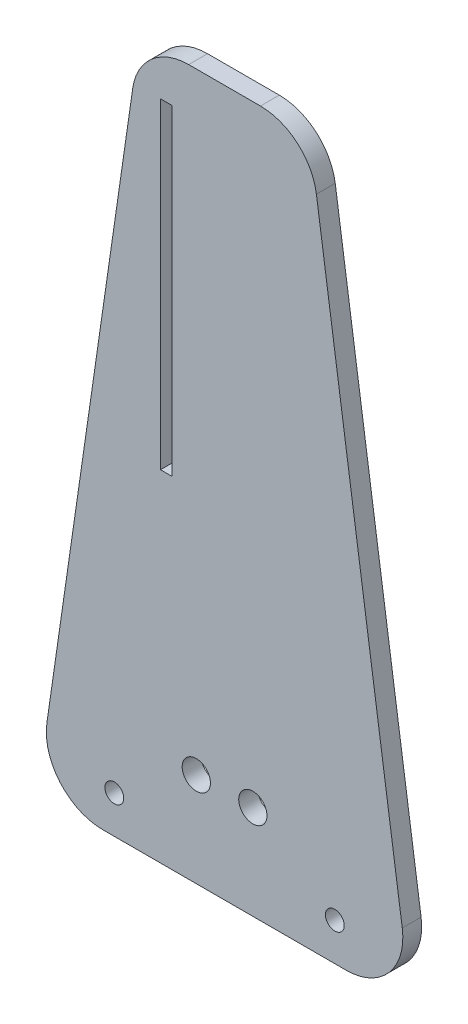
ISO-10303-21;
HEADER;
FILE_DESCRIPTION(('STEP AP214'),'2;1');
FILE_NAME('part.step','',(''),(''),'','','');
FILE_SCHEMA(('AUTOMOTIVE_DESIGN { 1 0 10303 214 1 1 1 1 }'));
ENDSEC;
DATA;
#1=APPLICATION_CONTEXT('core data for automotive mechanical design processes');
#2=APPLICATION_PROTOCOL_DEFINITION('international standard','automotive_design',2000,#1);
#3=PRODUCT_CONTEXT('',#1,'mechanical');
#4=PRODUCT('Part','Part','',(#3));
#5=PRODUCT_RELATED_PRODUCT_CATEGORY('part','',(#4));
#6=PRODUCT_DEFINITION_FORMATION('','',#4);
#7=PRODUCT_DEFINITION_CONTEXT('part definition',#1,'design');
#8=PRODUCT_DEFINITION('design','',#6,#7);
#9=PRODUCT_DEFINITION_SHAPE('','',#8);
#10=(LENGTH_UNIT() NAMED_UNIT(*) SI_UNIT(.MILLI.,.METRE.));
#11=(NAMED_UNIT(*) PLANE_ANGLE_UNIT() SI_UNIT($,.RADIAN.));
#12=(NAMED_UNIT(*) SI_UNIT($,.STERADIAN.) SOLID_ANGLE_UNIT());
#13=UNCERTAINTY_MEASURE_WITH_UNIT(LENGTH_MEASURE(1.E-05),#10,'distance_accuracy_value','');
#14=(GEOMETRIC_REPRESENTATION_CONTEXT(3) GLOBAL_UNCERTAINTY_ASSIGNED_CONTEXT((#13)) GLOBAL_UNIT_ASSIGNED_CONTEXT((#10,
#11,#12)) REPRESENTATION_CONTEXT('',''));
#15=CARTESIAN_POINT('',(0.,0.,0.));
#16=DIRECTION('',(0.,0.,1.));
#17=DIRECTION('',(1.,0.,0.));
#18=AXIS2_PLACEMENT_3D('',#15,#16,#17);
#19=CARTESIAN_POINT('',(-3.80670017831718,68.8779454447492,2.));
#20=DIRECTION('',(0.,0.,-1.));
#21=DIRECTION('',(-1.,0.,0.));
#22=AXIS2_PLACEMENT_3D('',#19,#20,#21);
#23=PLANE('',#22);
#24=CARTESIAN_POINT('',(-11.7,4.,2.));
#25=DIRECTION('',(0.,0.,1.));
#26=DIRECTION('',(-1.,0.,0.));
#27=AXIS2_PLACEMENT_3D('',#24,#25,#26);
#28=CIRCLE('',#27,1.);
#29=CARTESIAN_POINT('',(-12.7,4.,2.));
#30=VERTEX_POINT('',#29);
#31=EDGE_CURVE('E165',#30,#30,#28,.T.);
#32=ORIENTED_EDGE('',*,*,#31,.F.);
#33=EDGE_LOOP('',(#32));
#34=FACE_BOUND('',#33,.T.);
#35=CARTESIAN_POINT('',(11.7,4.,2.));
#36=DIRECTION('',(0.,0.,1.));
#37=DIRECTION('',(1.,0.,0.));
#38=AXIS2_PLACEMENT_3D('',#35,#36,#37);
#39=CIRCLE('',#38,1.);
#40=CARTESIAN_POINT('',(12.7,4.,2.));
#41=VERTEX_POINT('',#40);
#42=EDGE_CURVE('E171',#41,#41,#39,.T.);
#43=ORIENTED_EDGE('',*,*,#42,.F.);
#44=EDGE_LOOP('',(#43));
#45=FACE_BOUND('',#44,.T.);
#46=DIRECTION('',(-1.,0.,0.));
#47=VECTOR('',#46,1.);
#48=CARTESIAN_POINT('',(0.,74.8779454447492,2.));
#49=LINE('',#48,#47);
#50=CARTESIAN_POINT('',(3.80670017831714,74.8779454447492,2.));
#51=VERTEX_POINT('',#50);
#52=CARTESIAN_POINT('',(-3.80670017831714,74.8779454447492,2.));
#53=VERTEX_POINT('',#52);
#54=EDGE_CURVE('E177',#51,#53,#49,.T.);
#55=ORIENTED_EDGE('',*,*,#54,.T.);
#56=CARTESIAN_POINT('',(-3.80670017831718,68.8779454447492,2.));
#57=DIRECTION('',(0.,0.,1.));
#58=DIRECTION('',(-1.,0.,0.));
#59=AXIS2_PLACEMENT_3D('',#56,#57,#58);
#60=CIRCLE('',#59,6.);
#61=CARTESIAN_POINT('',(-9.74469337261031,69.7383156119031,2.));
#62=VERTEX_POINT('',#61);
#63=EDGE_CURVE('E180',#53,#62,#60,.T.);
#64=ORIENTED_EDGE('',*,*,#63,.T.);
#65=DIRECTION('',(-0.143395027858991,-0.989665532382188,0.));
#66=VECTOR('',#65,1.);
#67=CARTESIAN_POINT('',(-9.74469337261031,69.7383156119031,2.));
#68=LINE('',#67,#66);
#69=CARTESIAN_POINT('',(-18.8552306639949,6.86037016715395,2.));
#70=VERTEX_POINT('',#69);
#71=EDGE_CURVE('E183',#62,#70,#68,.T.);
#72=ORIENTED_EDGE('',*,*,#71,.T.);
#73=CARTESIAN_POINT('',(-12.9172374697018,6.,2.));
#74=DIRECTION('',(0.,0.,1.));
#75=DIRECTION('',(1.,0.,0.));
#76=AXIS2_PLACEMENT_3D('',#73,#74,#75);
#77=CIRCLE('',#76,6.);
#78=CARTESIAN_POINT('',(-12.9172374697017,0.,2.));
#79=VERTEX_POINT('',#78);
#80=EDGE_CURVE('E185',#70,#79,#77,.T.);
#81=ORIENTED_EDGE('',*,*,#80,.T.);
#82=DIRECTION('',(1.,0.,0.));
#83=VECTOR('',#82,1.);
#84=CARTESIAN_POINT('',(-12.9172374697017,0.,2.));
#85=LINE('',#84,#83);
#86=CARTESIAN_POINT('',(12.9172374697017,0.,2.));
#87=VERTEX_POINT('',#86);
#88=EDGE_CURVE('E187',#79,#87,#85,.T.);
#89=ORIENTED_EDGE('',*,*,#88,.T.);
#90=CARTESIAN_POINT('',(12.9172374697018,6.,2.));
#91=DIRECTION('',(0.,0.,1.));
#92=DIRECTION('',(1.,0.,0.));
#93=AXIS2_PLACEMENT_3D('',#90,#91,#92);
#94=CIRCLE('',#93,6.);
#95=CARTESIAN_POINT('',(18.8552306639949,6.86037016715395,2.));
#96=VERTEX_POINT('',#95);
#97=EDGE_CURVE('E189',#87,#96,#94,.T.);
#98=ORIENTED_EDGE('',*,*,#97,.T.);
#99=DIRECTION('',(-0.143395027858991,0.989665532382188,0.));
#100=VECTOR('',#99,1.);
#101=CARTESIAN_POINT('',(9.7446933726103,69.7383156119031,2.));
#102=LINE('',#101,#100);
#103=CARTESIAN_POINT('',(9.74469337261031,69.7383156119031,2.));
#104=VERTEX_POINT('',#103);
#105=EDGE_CURVE('E191',#96,#104,#102,.T.);
#106=ORIENTED_EDGE('',*,*,#105,.T.);
#107=CARTESIAN_POINT('',(3.80670017831717,68.8779454447492,2.));
#108=DIRECTION('',(0.,0.,1.));
#109=DIRECTION('',(1.,0.,0.));
#110=AXIS2_PLACEMENT_3D('',#107,#108,#109);
#111=CIRCLE('',#110,6.);
#112=EDGE_CURVE('E193',#104,#51,#111,.T.);
#113=ORIENTED_EDGE('',*,*,#112,.T.);
#114=EDGE_LOOP('',(#55,#64,#72,#81,#89,#98,#106,#113));
#115=FACE_BOUND('',#114,.T.);
#116=DIRECTION('',(-1.,0.,0.));
#117=VECTOR('',#116,1.);
#118=CARTESIAN_POINT('',(-5.60000000000111,70.2366456600926,2.));
#119=LINE('',#118,#117);
#120=CARTESIAN_POINT('',(-5.60000000000111,70.2366456600926,2.));
#121=VERTEX_POINT('',#120);
#122=CARTESIAN_POINT('',(-6.7999999999999,70.2366456600926,2.));
#123=VERTEX_POINT('',#122);
#124=EDGE_CURVE('E126',#121,#123,#119,.T.);
#125=ORIENTED_EDGE('',*,*,#124,.F.);
#126=DIRECTION('',(0.,1.,0.));
#127=VECTOR('',#126,1.);
#128=CARTESIAN_POINT('',(-5.60000000000111,36.1477136722925,2.));
#129=LINE('',#128,#127);
#130=CARTESIAN_POINT('',(-5.60000000000111,36.1477136722925,2.));
#131=VERTEX_POINT('',#130);
#132=EDGE_CURVE('E149',#131,#121,#129,.T.);
#133=ORIENTED_EDGE('',*,*,#132,.F.);
#134=DIRECTION('',(1.,0.,0.));
#135=VECTOR('',#134,1.);
#136=CARTESIAN_POINT('',(-6.7999999999999,36.1477136722925,2.));
#137=LINE('',#136,#135);
#138=CARTESIAN_POINT('',(-6.7999999999999,36.1477136722925,2.));
#139=VERTEX_POINT('',#138);
#140=EDGE_CURVE('E147',#139,#131,#137,.T.);
#141=ORIENTED_EDGE('',*,*,#140,.F.);
#142=DIRECTION('',(0.,-1.,0.));
#143=VECTOR('',#142,1.);
#144=CARTESIAN_POINT('',(-6.7999999999999,70.2366456600926,2.));
#145=LINE('',#144,#143);
#146=EDGE_CURVE('E134',#123,#139,#145,.T.);
#147=ORIENTED_EDGE('',*,*,#146,.F.);
#148=EDGE_LOOP('',(#125,#133,#141,#147));
#149=FACE_BOUND('',#148,.T.);
#150=CARTESIAN_POINT('',(-3.,10.,2.));
#151=DIRECTION('',(0.,0.,1.));
#152=DIRECTION('',(1.,0.,0.));
#153=AXIS2_PLACEMENT_3D('',#150,#151,#152);
#154=CIRCLE('',#153,1.5);
#155=CARTESIAN_POINT('',(-1.5,10.,2.));
#156=VERTEX_POINT('',#155);
#157=EDGE_CURVE('E155',#156,#156,#154,.T.);
#158=ORIENTED_EDGE('',*,*,#157,.F.);
#159=EDGE_LOOP('',(#158));
#160=FACE_BOUND('',#159,.T.);
#161=CARTESIAN_POINT('',(3.,10.,2.));
#162=DIRECTION('',(0.,0.,1.));
#163=DIRECTION('',(1.,0.,0.));
#164=AXIS2_PLACEMENT_3D('',#161,#162,#163);
#165=CIRCLE('',#164,1.5);
#166=CARTESIAN_POINT('',(4.5,10.,2.));
#167=VERTEX_POINT('',#166);
#168=EDGE_CURVE('E432',#167,#167,#165,.T.);
#169=ORIENTED_EDGE('',*,*,#168,.F.);
#170=EDGE_LOOP('',(#169));
#171=FACE_BOUND('',#170,.T.);
#172=ADVANCED_FACE('F37',(#34,#45,#115,#149,#160,#171),#23,.F.);
#173=CARTESIAN_POINT('',(-3.80670017831718,68.8779454447492,0.));
#174=DIRECTION('',(0.,0.,-1.));
#175=DIRECTION('',(-1.,0.,0.));
#176=AXIS2_PLACEMENT_3D('',#173,#174,#175);
#177=PLANE('',#176);
#178=CARTESIAN_POINT('',(-3.,10.,0.));
#179=DIRECTION('',(0.,0.,1.));
#180=DIRECTION('',(1.,0.,0.));
#181=AXIS2_PLACEMENT_3D('',#178,#179,#180);
#182=CIRCLE('',#181,1.5);
#183=CARTESIAN_POINT('',(-1.5,10.,0.));
#184=VERTEX_POINT('',#183);
#185=EDGE_CURVE('E438',#184,#184,#182,.T.);
#186=ORIENTED_EDGE('',*,*,#185,.T.);
#187=EDGE_LOOP('',(#186));
#188=FACE_BOUND('',#187,.T.);
#189=CARTESIAN_POINT('',(11.7,4.,0.));
#190=DIRECTION('',(0.,0.,1.));
#191=DIRECTION('',(1.,0.,0.));
#192=AXIS2_PLACEMENT_3D('',#189,#190,#191);
#193=CIRCLE('',#192,1.);
#194=CARTESIAN_POINT('',(12.7,4.,0.));
#195=VERTEX_POINT('',#194);
#196=EDGE_CURVE('E168',#195,#195,#193,.T.);
#197=ORIENTED_EDGE('',*,*,#196,.T.);
#198=EDGE_LOOP('',(#197));
#199=FACE_BOUND('',#198,.T.);
#200=CARTESIAN_POINT('',(-3.80670017831718,68.8779454447492,0.));
#201=DIRECTION('',(0.,0.,1.));
#202=DIRECTION('',(-1.,0.,0.));
#203=AXIS2_PLACEMENT_3D('',#200,#201,#202);
#204=CIRCLE('',#203,6.);
#205=CARTESIAN_POINT('',(-3.80670017831714,74.8779454447492,0.));
#206=VERTEX_POINT('',#205);
#207=CARTESIAN_POINT('',(-9.74469337261031,69.7383156119031,0.));
#208=VERTEX_POINT('',#207);
#209=EDGE_CURVE('E174',#206,#208,#204,.T.);
#210=ORIENTED_EDGE('',*,*,#209,.F.);
#211=DIRECTION('',(-1.,0.,0.));
#212=VECTOR('',#211,1.);
#213=CARTESIAN_POINT('',(0.,74.8779454447492,0.));
#214=LINE('',#213,#212);
#215=CARTESIAN_POINT('',(3.80670017831714,74.8779454447492,0.));
#216=VERTEX_POINT('',#215);
#217=EDGE_CURVE('E181',#216,#206,#214,.T.);
#218=ORIENTED_EDGE('',*,*,#217,.F.);
#219=CARTESIAN_POINT('',(3.80670017831717,68.8779454447492,0.));
#220=DIRECTION('',(0.,0.,1.));
#221=DIRECTION('',(1.,0.,0.));
#222=AXIS2_PLACEMENT_3D('',#219,#220,#221);
#223=CIRCLE('',#222,6.);
#224=CARTESIAN_POINT('',(9.74469337261031,69.7383156119031,0.));
#225=VERTEX_POINT('',#224);
#226=EDGE_CURVE('E208',#225,#216,#223,.T.);
#227=ORIENTED_EDGE('',*,*,#226,.F.);
#228=DIRECTION('',(-0.143395027858991,0.989665532382188,0.));
#229=VECTOR('',#228,1.);
#230=CARTESIAN_POINT('',(9.7446933726103,69.7383156119031,0.));
#231=LINE('',#230,#229);
#232=CARTESIAN_POINT('',(18.8552306639949,6.86037016715395,0.));
#233=VERTEX_POINT('',#232);
#234=EDGE_CURVE('E206',#233,#225,#231,.T.);
#235=ORIENTED_EDGE('',*,*,#234,.F.);
#236=CARTESIAN_POINT('',(12.9172374697018,6.,0.));
#237=DIRECTION('',(0.,0.,1.));
#238=DIRECTION('',(1.,0.,0.));
#239=AXIS2_PLACEMENT_3D('',#236,#237,#238);
#240=CIRCLE('',#239,6.);
#241=CARTESIAN_POINT('',(12.9172374697017,0.,0.));
#242=VERTEX_POINT('',#241);
#243=EDGE_CURVE('E204',#242,#233,#240,.T.);
#244=ORIENTED_EDGE('',*,*,#243,.F.);
#245=DIRECTION('',(1.,0.,0.));
#246=VECTOR('',#245,1.);
#247=CARTESIAN_POINT('',(-12.9172374697017,0.,0.));
#248=LINE('',#247,#246);
#249=CARTESIAN_POINT('',(-12.9172374697017,0.,0.));
#250=VERTEX_POINT('',#249);
#251=EDGE_CURVE('E202',#250,#242,#248,.T.);
#252=ORIENTED_EDGE('',*,*,#251,.F.);
#253=CARTESIAN_POINT('',(-12.9172374697018,6.,0.));
#254=DIRECTION('',(0.,0.,1.));
#255=DIRECTION('',(1.,0.,0.));
#256=AXIS2_PLACEMENT_3D('',#253,#254,#255);
#257=CIRCLE('',#256,6.);
#258=CARTESIAN_POINT('',(-18.8552306639949,6.86037016715395,0.));
#259=VERTEX_POINT('',#258);
#260=EDGE_CURVE('E200',#259,#250,#257,.T.);
#261=ORIENTED_EDGE('',*,*,#260,.F.);
#262=DIRECTION('',(-0.143395027858991,-0.989665532382188,0.));
#263=VECTOR('',#262,1.);
#264=CARTESIAN_POINT('',(-9.74469337261031,69.7383156119031,0.));
#265=LINE('',#264,#263);
#266=EDGE_CURVE('E198',#208,#259,#265,.T.);
#267=ORIENTED_EDGE('',*,*,#266,.F.);
#268=EDGE_LOOP('',(#210,#218,#227,#235,#244,#252,#261,#267));
#269=FACE_BOUND('',#268,.T.);
#270=CARTESIAN_POINT('',(-11.7,4.,0.));
#271=DIRECTION('',(0.,0.,1.));
#272=DIRECTION('',(-1.,0.,0.));
#273=AXIS2_PLACEMENT_3D('',#270,#271,#272);
#274=CIRCLE('',#273,1.);
#275=CARTESIAN_POINT('',(-12.7,4.,0.));
#276=VERTEX_POINT('',#275);
#277=EDGE_CURVE('E142',#276,#276,#274,.T.);
#278=ORIENTED_EDGE('',*,*,#277,.T.);
#279=EDGE_LOOP('',(#278));
#280=FACE_BOUND('',#279,.T.);
#281=DIRECTION('',(0.,1.,0.));
#282=VECTOR('',#281,1.);
#283=CARTESIAN_POINT('',(-5.60000000000111,36.1477136722925,0.));
#284=LINE('',#283,#282);
#285=CARTESIAN_POINT('',(-5.60000000000111,36.1477136722925,0.));
#286=VERTEX_POINT('',#285);
#287=CARTESIAN_POINT('',(-5.60000000000111,70.2366456600926,0.));
#288=VERTEX_POINT('',#287);
#289=EDGE_CURVE('E135',#286,#288,#284,.T.);
#290=ORIENTED_EDGE('',*,*,#289,.T.);
#291=DIRECTION('',(-1.,0.,0.));
#292=VECTOR('',#291,1.);
#293=CARTESIAN_POINT('',(-5.60000000000111,70.2366456600926,0.));
#294=LINE('',#293,#292);
#295=CARTESIAN_POINT('',(-6.7999999999999,70.2366456600926,0.));
#296=VERTEX_POINT('',#295);
#297=EDGE_CURVE('E60',#288,#296,#294,.T.);
#298=ORIENTED_EDGE('',*,*,#297,.T.);
#299=DIRECTION('',(0.,-1.,0.));
#300=VECTOR('',#299,1.);
#301=CARTESIAN_POINT('',(-6.7999999999999,70.2366456600926,0.));
#302=LINE('',#301,#300);
#303=CARTESIAN_POINT('',(-6.7999999999999,36.1477136722925,0.));
#304=VERTEX_POINT('',#303);
#305=EDGE_CURVE('E141',#296,#304,#302,.T.);
#306=ORIENTED_EDGE('',*,*,#305,.T.);
#307=DIRECTION('',(1.,0.,0.));
#308=VECTOR('',#307,1.);
#309=CARTESIAN_POINT('',(-6.7999999999999,36.1477136722925,0.));
#310=LINE('',#309,#308);
#311=EDGE_CURVE('E157',#304,#286,#310,.T.);
#312=ORIENTED_EDGE('',*,*,#311,.T.);
#313=EDGE_LOOP('',(#290,#298,#306,#312));
#314=FACE_BOUND('',#313,.T.);
#315=CARTESIAN_POINT('',(3.,10.,0.));
#316=DIRECTION('',(0.,0.,1.));
#317=DIRECTION('',(1.,0.,0.));
#318=AXIS2_PLACEMENT_3D('',#315,#316,#317);
#319=CIRCLE('',#318,1.5);
#320=CARTESIAN_POINT('',(4.5,10.,0.));
#321=VERTEX_POINT('',#320);
#322=EDGE_CURVE('E435',#321,#321,#319,.T.);
#323=ORIENTED_EDGE('',*,*,#322,.T.);
#324=EDGE_LOOP('',(#323));
#325=FACE_BOUND('',#324,.T.);
#326=ADVANCED_FACE('F238',(#188,#199,#269,#280,#314,#325),#177,.T.);
#327=CARTESIAN_POINT('',(-3.80670017831718,68.8779454447492,2.));
#328=DIRECTION('',(0.,0.,-1.));
#329=DIRECTION('',(-1.,0.,0.));
#330=AXIS2_PLACEMENT_3D('',#327,#328,#329);
#331=CYLINDRICAL_SURFACE('',#330,6.);
#332=ORIENTED_EDGE('',*,*,#209,.T.);
#333=DIRECTION('',(0.,0.,-1.));
#334=VECTOR('',#333,1.);
#335=CARTESIAN_POINT('',(-9.74469337261031,69.7383156119031,2.));
#336=LINE('',#335,#334);
#337=EDGE_CURVE('E45',#62,#208,#336,.T.);
#338=ORIENTED_EDGE('',*,*,#337,.F.);
#339=ORIENTED_EDGE('',*,*,#63,.F.);
#340=DIRECTION('',(0.,0.,-1.));
#341=VECTOR('',#340,1.);
#342=CARTESIAN_POINT('',(-3.80670017831714,74.8779454447492,2.));
#343=LINE('',#342,#341);
#344=EDGE_CURVE('E11',#53,#206,#343,.T.);
#345=ORIENTED_EDGE('',*,*,#344,.T.);
#346=EDGE_LOOP('',(#332,#338,#339,#345));
#347=FACE_BOUND('',#346,.T.);
#348=ADVANCED_FACE('F39',(#347),#331,.T.);
#349=CARTESIAN_POINT('',(-9.74469337261031,69.7383156119031,2.));
#350=DIRECTION('',(0.989665532382188,-0.143395027858991,0.));
#351=DIRECTION('',(0.143395027858991,0.989665532382188,0.));
#352=AXIS2_PLACEMENT_3D('',#349,#350,#351);
#353=PLANE('',#352);
#354=ORIENTED_EDGE('',*,*,#266,.T.);
#355=DIRECTION('',(0.,0.,-1.));
#356=VECTOR('',#355,1.);
#357=CARTESIAN_POINT('',(-18.8552306639949,6.86037016715395,2.));
#358=LINE('',#357,#356);
#359=EDGE_CURVE('E225',#70,#259,#358,.T.);
#360=ORIENTED_EDGE('',*,*,#359,.F.);
#361=ORIENTED_EDGE('',*,*,#71,.F.);
#362=ORIENTED_EDGE('',*,*,#337,.T.);
#363=EDGE_LOOP('',(#354,#360,#361,#362));
#364=FACE_BOUND('',#363,.T.);
#365=ADVANCED_FACE('F232',(#364),#353,.F.);
#366=CARTESIAN_POINT('',(-12.9172374697018,6.,2.));
#367=DIRECTION('',(0.,0.,-1.));
#368=DIRECTION('',(-1.,0.,0.));
#369=AXIS2_PLACEMENT_3D('',#366,#367,#368);
#370=CYLINDRICAL_SURFACE('',#369,6.);
#371=ORIENTED_EDGE('',*,*,#260,.T.);
#372=DIRECTION('',(0.,0.,-1.));
#373=VECTOR('',#372,1.);
#374=CARTESIAN_POINT('',(-12.9172374697017,0.,2.));
#375=LINE('',#374,#373);
#376=EDGE_CURVE('E222',#79,#250,#375,.T.);
#377=ORIENTED_EDGE('',*,*,#376,.F.);
#378=ORIENTED_EDGE('',*,*,#80,.F.);
#379=ORIENTED_EDGE('',*,*,#359,.T.);
#380=EDGE_LOOP('',(#371,#377,#378,#379));
#381=FACE_BOUND('',#380,.T.);
#382=ADVANCED_FACE('F245',(#381),#370,.T.);
#383=CARTESIAN_POINT('',(-12.9172374697017,0.,2.));
#384=DIRECTION('',(0.,1.,0.));
#385=DIRECTION('',(0.,0.,1.));
#386=AXIS2_PLACEMENT_3D('',#383,#384,#385);
#387=PLANE('',#386);
#388=ORIENTED_EDGE('',*,*,#251,.T.);
#389=DIRECTION('',(0.,0.,-1.));
#390=VECTOR('',#389,1.);
#391=CARTESIAN_POINT('',(12.9172374697017,0.,2.));
#392=LINE('',#391,#390);
#393=EDGE_CURVE('E219',#87,#242,#392,.T.);
#394=ORIENTED_EDGE('',*,*,#393,.F.);
#395=ORIENTED_EDGE('',*,*,#88,.F.);
#396=ORIENTED_EDGE('',*,*,#376,.T.);
#397=EDGE_LOOP('',(#388,#394,#395,#396));
#398=FACE_BOUND('',#397,.T.);
#399=ADVANCED_FACE('F249',(#398),#387,.F.);
#400=CARTESIAN_POINT('',(12.9172374697018,6.,2.));
#401=DIRECTION('',(0.,0.,-1.));
#402=DIRECTION('',(-1.,0.,0.));
#403=AXIS2_PLACEMENT_3D('',#400,#401,#402);
#404=CYLINDRICAL_SURFACE('',#403,6.);
#405=ORIENTED_EDGE('',*,*,#243,.T.);
#406=DIRECTION('',(0.,0.,-1.));
#407=VECTOR('',#406,1.);
#408=CARTESIAN_POINT('',(18.8552306639949,6.86037016715395,2.));
#409=LINE('',#408,#407);
#410=EDGE_CURVE('E216',#96,#233,#409,.T.);
#411=ORIENTED_EDGE('',*,*,#410,.F.);
#412=ORIENTED_EDGE('',*,*,#97,.F.);
#413=ORIENTED_EDGE('',*,*,#393,.T.);
#414=EDGE_LOOP('',(#405,#411,#412,#413));
#415=FACE_BOUND('',#414,.T.);
#416=ADVANCED_FACE('F268',(#415),#404,.T.);
#417=CARTESIAN_POINT('',(9.7446933726103,69.7383156119031,2.));
#418=DIRECTION('',(-0.989665532382188,-0.143395027858991,0.));
#419=DIRECTION('',(0.143395027858991,-0.989665532382188,0.));
#420=AXIS2_PLACEMENT_3D('',#417,#418,#419);
#421=PLANE('',#420);
#422=ORIENTED_EDGE('',*,*,#234,.T.);
#423=DIRECTION('',(0.,0.,-1.));
#424=VECTOR('',#423,1.);
#425=CARTESIAN_POINT('',(9.74469337261031,69.7383156119031,2.));
#426=LINE('',#425,#424);
#427=EDGE_CURVE('E213',#104,#225,#426,.T.);
#428=ORIENTED_EDGE('',*,*,#427,.F.);
#429=ORIENTED_EDGE('',*,*,#105,.F.);
#430=ORIENTED_EDGE('',*,*,#410,.T.);
#431=EDGE_LOOP('',(#422,#428,#429,#430));
#432=FACE_BOUND('',#431,.T.);
#433=ADVANCED_FACE('F266',(#432),#421,.F.);
#434=CARTESIAN_POINT('',(3.80670017831717,68.8779454447492,2.));
#435=DIRECTION('',(0.,0.,-1.));
#436=DIRECTION('',(-1.,0.,0.));
#437=AXIS2_PLACEMENT_3D('',#434,#435,#436);
#438=CYLINDRICAL_SURFACE('',#437,6.);
#439=ORIENTED_EDGE('',*,*,#226,.T.);
#440=DIRECTION('',(0.,0.,-1.));
#441=VECTOR('',#440,1.);
#442=CARTESIAN_POINT('',(3.80670017831714,74.8779454447492,2.));
#443=LINE('',#442,#441);
#444=EDGE_CURVE('E196',#51,#216,#443,.T.);
#445=ORIENTED_EDGE('',*,*,#444,.F.);
#446=ORIENTED_EDGE('',*,*,#112,.F.);
#447=ORIENTED_EDGE('',*,*,#427,.T.);
#448=EDGE_LOOP('',(#439,#445,#446,#447));
#449=FACE_BOUND('',#448,.T.);
#450=ADVANCED_FACE('F261',(#449),#438,.T.);
#451=CARTESIAN_POINT('',(0.,74.8779454447492,2.));
#452=DIRECTION('',(0.,-1.,0.));
#453=DIRECTION('',(0.,0.,-1.));
#454=AXIS2_PLACEMENT_3D('',#451,#452,#453);
#455=PLANE('',#454);
#456=ORIENTED_EDGE('',*,*,#217,.T.);
#457=ORIENTED_EDGE('',*,*,#344,.F.);
#458=ORIENTED_EDGE('',*,*,#54,.F.);
#459=ORIENTED_EDGE('',*,*,#444,.T.);
#460=EDGE_LOOP('',(#456,#457,#458,#459));
#461=FACE_BOUND('',#460,.T.);
#462=ADVANCED_FACE('F256',(#461),#455,.F.);
#463=CARTESIAN_POINT('',(11.7,4.,2.));
#464=DIRECTION('',(0.,0.,-1.));
#465=DIRECTION('',(-1.,0.,0.));
#466=AXIS2_PLACEMENT_3D('',#463,#464,#465);
#467=CYLINDRICAL_SURFACE('',#466,1.);
#468=ORIENTED_EDGE('',*,*,#42,.T.);
#469=EDGE_LOOP('',(#468));
#470=FACE_BOUND('',#469,.T.);
#471=ORIENTED_EDGE('',*,*,#196,.F.);
#472=EDGE_LOOP('',(#471));
#473=FACE_BOUND('',#472,.T.);
#474=ADVANCED_FACE('F288',(#470,#473),#467,.F.);
#475=CARTESIAN_POINT('',(-11.7,4.,2.));
#476=DIRECTION('',(0.,0.,-1.));
#477=DIRECTION('',(-1.,0.,0.));
#478=AXIS2_PLACEMENT_3D('',#475,#476,#477);
#479=CYLINDRICAL_SURFACE('',#478,1.);
#480=ORIENTED_EDGE('',*,*,#31,.T.);
#481=EDGE_LOOP('',(#480));
#482=FACE_BOUND('',#481,.T.);
#483=ORIENTED_EDGE('',*,*,#277,.F.);
#484=EDGE_LOOP('',(#483));
#485=FACE_BOUND('',#484,.T.);
#486=ADVANCED_FACE('F308',(#482,#485),#479,.F.);
#487=CARTESIAN_POINT('',(-5.60000000000111,70.2366456600926,2.));
#488=DIRECTION('',(0.,-1.,0.));
#489=DIRECTION('',(0.,0.,-1.));
#490=AXIS2_PLACEMENT_3D('',#487,#488,#489);
#491=PLANE('',#490);
#492=ORIENTED_EDGE('',*,*,#297,.F.);
#493=DIRECTION('',(0.,0.,-1.));
#494=VECTOR('',#493,1.);
#495=CARTESIAN_POINT('',(-5.60000000000111,70.2366456600926,2.));
#496=LINE('',#495,#494);
#497=EDGE_CURVE('E130',#121,#288,#496,.T.);
#498=ORIENTED_EDGE('',*,*,#497,.F.);
#499=ORIENTED_EDGE('',*,*,#124,.T.);
#500=DIRECTION('',(0.,0.,-1.));
#501=VECTOR('',#500,1.);
#502=CARTESIAN_POINT('',(-6.7999999999999,70.2366456600926,2.));
#503=LINE('',#502,#501);
#504=EDGE_CURVE('E129',#123,#296,#503,.T.);
#505=ORIENTED_EDGE('',*,*,#504,.T.);
#506=EDGE_LOOP('',(#492,#498,#499,#505));
#507=FACE_BOUND('',#506,.T.);
#508=ADVANCED_FACE('F128',(#507),#491,.T.);
#509=CARTESIAN_POINT('',(-6.7999999999999,70.2366456600926,2.));
#510=DIRECTION('',(1.,0.,0.));
#511=DIRECTION('',(0.,1.,0.));
#512=AXIS2_PLACEMENT_3D('',#509,#510,#511);
#513=PLANE('',#512);
#514=ORIENTED_EDGE('',*,*,#305,.F.);
#515=ORIENTED_EDGE('',*,*,#504,.F.);
#516=ORIENTED_EDGE('',*,*,#146,.T.);
#517=DIRECTION('',(0.,0.,-1.));
#518=VECTOR('',#517,1.);
#519=CARTESIAN_POINT('',(-6.7999999999999,36.1477136722925,2.));
#520=LINE('',#519,#518);
#521=EDGE_CURVE('E143',#139,#304,#520,.T.);
#522=ORIENTED_EDGE('',*,*,#521,.T.);
#523=EDGE_LOOP('',(#514,#515,#516,#522));
#524=FACE_BOUND('',#523,.T.);
#525=ADVANCED_FACE('F138',(#524),#513,.T.);
#526=CARTESIAN_POINT('',(-6.7999999999999,36.1477136722925,2.));
#527=DIRECTION('',(0.,1.,0.));
#528=DIRECTION('',(0.,0.,1.));
#529=AXIS2_PLACEMENT_3D('',#526,#527,#528);
#530=PLANE('',#529);
#531=ORIENTED_EDGE('',*,*,#311,.F.);
#532=ORIENTED_EDGE('',*,*,#521,.F.);
#533=ORIENTED_EDGE('',*,*,#140,.T.);
#534=DIRECTION('',(0.,0.,-1.));
#535=VECTOR('',#534,1.);
#536=CARTESIAN_POINT('',(-5.60000000000111,36.1477136722925,2.));
#537=LINE('',#536,#535);
#538=EDGE_CURVE('E52',#131,#286,#537,.T.);
#539=ORIENTED_EDGE('',*,*,#538,.T.);
#540=EDGE_LOOP('',(#531,#532,#533,#539));
#541=FACE_BOUND('',#540,.T.);
#542=ADVANCED_FACE('F327',(#541),#530,.T.);
#543=CARTESIAN_POINT('',(-5.60000000000111,36.1477136722925,2.));
#544=DIRECTION('',(-1.,0.,0.));
#545=DIRECTION('',(0.,0.,1.));
#546=AXIS2_PLACEMENT_3D('',#543,#544,#545);
#547=PLANE('',#546);
#548=ORIENTED_EDGE('',*,*,#289,.F.);
#549=ORIENTED_EDGE('',*,*,#538,.F.);
#550=ORIENTED_EDGE('',*,*,#132,.T.);
#551=ORIENTED_EDGE('',*,*,#497,.T.);
#552=EDGE_LOOP('',(#548,#549,#550,#551));
#553=FACE_BOUND('',#552,.T.);
#554=ADVANCED_FACE('F334',(#553),#547,.T.);
#555=CARTESIAN_POINT('',(-3.,10.,2.));
#556=DIRECTION('',(0.,0.,-1.));
#557=DIRECTION('',(-1.,0.,0.));
#558=AXIS2_PLACEMENT_3D('',#555,#556,#557);
#559=CYLINDRICAL_SURFACE('',#558,1.5);
#560=ORIENTED_EDGE('',*,*,#157,.T.);
#561=EDGE_LOOP('',(#560));
#562=FACE_BOUND('',#561,.T.);
#563=ORIENTED_EDGE('',*,*,#185,.F.);
#564=EDGE_LOOP('',(#563));
#565=FACE_BOUND('',#564,.T.);
#566=ADVANCED_FACE('F342',(#562,#565),#559,.F.);
#567=CARTESIAN_POINT('',(3.,10.,2.));
#568=DIRECTION('',(0.,0.,-1.));
#569=DIRECTION('',(-1.,0.,0.));
#570=AXIS2_PLACEMENT_3D('',#567,#568,#569);
#571=CYLINDRICAL_SURFACE('',#570,1.5);
#572=ORIENTED_EDGE('',*,*,#168,.T.);
#573=EDGE_LOOP('',(#572));
#574=FACE_BOUND('',#573,.T.);
#575=ORIENTED_EDGE('',*,*,#322,.F.);
#576=EDGE_LOOP('',(#575));
#577=FACE_BOUND('',#576,.T.);
#578=ADVANCED_FACE('F349',(#574,#577),#571,.F.);
#579=CLOSED_SHELL('',(#172,#326,#348,#365,#382,#399,#416,#433,#450,#462,#474,#486,#508,#525,
#542,#554,#566,#578));
#580=MANIFOLD_SOLID_BREP('B2',#579);
#581=ADVANCED_BREP_SHAPE_REPRESENTATION('',(#18,#580),#14);
#582=SHAPE_DEFINITION_REPRESENTATION(#9,#581);
ENDSEC;
END-ISO-10303-21;
